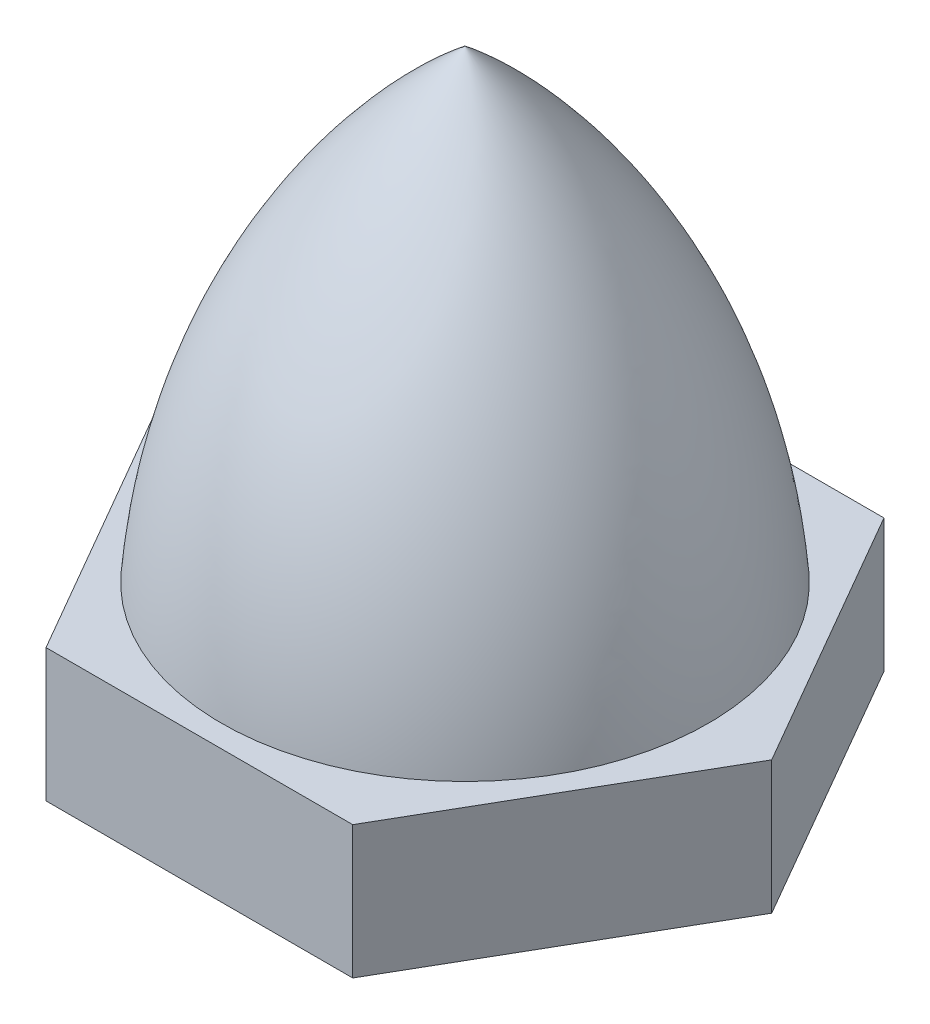
ISO-10303-21;
HEADER;
FILE_DESCRIPTION(('STEP AP214'),'2;1');
FILE_NAME('part.step','',(''),(''),'','','');
FILE_SCHEMA(('AUTOMOTIVE_DESIGN { 1 0 10303 214 1 1 1 1 }'));
ENDSEC;
DATA;
#1=APPLICATION_CONTEXT('core data for automotive mechanical design processes');
#2=APPLICATION_PROTOCOL_DEFINITION('international standard','automotive_design',2000,#1);
#3=PRODUCT_CONTEXT('',#1,'mechanical');
#4=PRODUCT('Part','Part','',(#3));
#5=PRODUCT_RELATED_PRODUCT_CATEGORY('part','',(#4));
#6=PRODUCT_DEFINITION_FORMATION('','',#4);
#7=PRODUCT_DEFINITION_CONTEXT('part definition',#1,'design');
#8=PRODUCT_DEFINITION('design','',#6,#7);
#9=PRODUCT_DEFINITION_SHAPE('','',#8);
#10=(LENGTH_UNIT() NAMED_UNIT(*) SI_UNIT(.MILLI.,.METRE.));
#11=(NAMED_UNIT(*) PLANE_ANGLE_UNIT() SI_UNIT($,.RADIAN.));
#12=(NAMED_UNIT(*) SI_UNIT($,.STERADIAN.) SOLID_ANGLE_UNIT());
#13=UNCERTAINTY_MEASURE_WITH_UNIT(LENGTH_MEASURE(1.E-05),#10,'distance_accuracy_value','');
#14=(GEOMETRIC_REPRESENTATION_CONTEXT(3) GLOBAL_UNCERTAINTY_ASSIGNED_CONTEXT((#13)) GLOBAL_UNIT_ASSIGNED_CONTEXT((#10,
#11,#12)) REPRESENTATION_CONTEXT('',''));
#15=CARTESIAN_POINT('',(0.,0.,0.));
#16=DIRECTION('',(0.,0.,1.));
#17=DIRECTION('',(1.,0.,0.));
#18=AXIS2_PLACEMENT_3D('',#15,#16,#17);
#19=CARTESIAN_POINT('',(0.,14.8986142757316,0.));
#20=DIRECTION('',(0.,-1.,0.));
#21=DIRECTION('',(0.,0.,-1.));
#22=AXIS2_PLACEMENT_3D('',#19,#20,#21);
#23=PLANE('',#22);
#24=DIRECTION('',(-0.5,0.,0.866025403784439));
#25=VECTOR('',#24,1.);
#26=CARTESIAN_POINT('',(18.0071692327859,14.8986142757316,0.));
#27=LINE('',#26,#25);
#28=CARTESIAN_POINT('',(18.0071692327859,14.8986142757316,0.));
#29=VERTEX_POINT('',#28);
#30=CARTESIAN_POINT('',(14.5430676176482,14.8986142757316,6.));
#31=VERTEX_POINT('',#30);
#32=EDGE_CURVE('E122',#29,#31,#27,.T.);
#33=ORIENTED_EDGE('',*,*,#32,.F.);
#34=DIRECTION('',(0.5,0.,0.866025403784439));
#35=VECTOR('',#34,1.);
#36=CARTESIAN_POINT('',(14.5430676176482,14.8986142757316,-6.));
#37=LINE('',#36,#35);
#38=CARTESIAN_POINT('',(14.5430676176482,14.8986142757316,-6.));
#39=VERTEX_POINT('',#38);
#40=EDGE_CURVE('E78',#39,#29,#37,.T.);
#41=ORIENTED_EDGE('',*,*,#40,.F.);
#42=DIRECTION('',(1.,0.,0.));
#43=VECTOR('',#42,1.);
#44=CARTESIAN_POINT('',(7.61486438737266,14.8986142757316,-6.));
#45=LINE('',#44,#43);
#46=CARTESIAN_POINT('',(7.61486438737266,14.8986142757316,-6.));
#47=VERTEX_POINT('',#46);
#48=EDGE_CURVE('E131',#47,#39,#45,.T.);
#49=ORIENTED_EDGE('',*,*,#48,.F.);
#50=DIRECTION('',(0.5,0.,-0.866025403784439));
#51=VECTOR('',#50,1.);
#52=CARTESIAN_POINT('',(4.15076277223491,14.8986142757316,0.));
#53=LINE('',#52,#51);
#54=CARTESIAN_POINT('',(4.15076277223491,14.8986142757316,0.));
#55=VERTEX_POINT('',#54);
#56=EDGE_CURVE('E110',#55,#47,#53,.T.);
#57=ORIENTED_EDGE('',*,*,#56,.F.);
#58=DIRECTION('',(-0.5,0.,-0.866025403784439));
#59=VECTOR('',#58,1.);
#60=CARTESIAN_POINT('',(7.61486438737266,14.8986142757316,6.));
#61=LINE('',#60,#59);
#62=CARTESIAN_POINT('',(7.61486438737266,14.8986142757316,6.));
#63=VERTEX_POINT('',#62);
#64=EDGE_CURVE('E128',#63,#55,#61,.T.);
#65=ORIENTED_EDGE('',*,*,#64,.F.);
#66=DIRECTION('',(-1.,0.,0.));
#67=VECTOR('',#66,1.);
#68=CARTESIAN_POINT('',(14.5430676176482,14.8986142757316,6.));
#69=LINE('',#68,#67);
#70=EDGE_CURVE('E125',#31,#63,#69,.T.);
#71=ORIENTED_EDGE('',*,*,#70,.F.);
#72=EDGE_LOOP('',(#33,#41,#49,#57,#65,#71));
#73=FACE_BOUND('',#72,.T.);
#74=CARTESIAN_POINT('',(11.0789660025104,14.8986142757316,0.));
#75=DIRECTION('',(0.,-1.,0.));
#76=DIRECTION('',(0.,0.,-1.));
#77=AXIS2_PLACEMENT_3D('',#74,#75,#76);
#78=CIRCLE('',#77,5.5);
#79=CARTESIAN_POINT('',(11.0789660025104,14.8986142757316,-5.5));
#80=VERTEX_POINT('',#79);
#81=EDGE_CURVE('E11',#80,#80,#78,.T.);
#82=ORIENTED_EDGE('',*,*,#81,.T.);
#83=EDGE_LOOP('',(#82));
#84=FACE_BOUND('',#83,.T.);
#85=ADVANCED_FACE('F33',(#73,#84),#23,.F.);
#86=CARTESIAN_POINT('',(18.0071692327859,11.8986142757316,0.));
#87=DIRECTION('',(-0.866025403784439,0.,-0.5));
#88=DIRECTION('',(-0.5,0.,0.866025403784439));
#89=AXIS2_PLACEMENT_3D('',#86,#87,#88);
#90=PLANE('',#89);
#91=ORIENTED_EDGE('',*,*,#32,.T.);
#92=DIRECTION('',(0.,1.,0.));
#93=VECTOR('',#92,1.);
#94=CARTESIAN_POINT('',(14.5430676176482,11.8986142757316,6.));
#95=LINE('',#94,#93);
#96=CARTESIAN_POINT('',(14.5430676176482,11.8986142757316,6.));
#97=VERTEX_POINT('',#96);
#98=EDGE_CURVE('E41',#97,#31,#95,.T.);
#99=ORIENTED_EDGE('',*,*,#98,.F.);
#100=DIRECTION('',(-0.5,0.,0.866025403784439));
#101=VECTOR('',#100,1.);
#102=CARTESIAN_POINT('',(18.0071692327859,11.8986142757316,0.));
#103=LINE('',#102,#101);
#104=CARTESIAN_POINT('',(18.0071692327859,11.8986142757316,0.));
#105=VERTEX_POINT('',#104);
#106=EDGE_CURVE('E134',#105,#97,#103,.T.);
#107=ORIENTED_EDGE('',*,*,#106,.F.);
#108=DIRECTION('',(0.,1.,0.));
#109=VECTOR('',#108,1.);
#110=CARTESIAN_POINT('',(18.0071692327859,11.8986142757316,0.));
#111=LINE('',#110,#109);
#112=EDGE_CURVE('E118',#105,#29,#111,.T.);
#113=ORIENTED_EDGE('',*,*,#112,.T.);
#114=EDGE_LOOP('',(#91,#99,#107,#113));
#115=FACE_BOUND('',#114,.T.);
#116=ADVANCED_FACE('F145',(#115),#90,.F.);
#117=CARTESIAN_POINT('',(14.5430676176482,11.8986142757316,6.));
#118=DIRECTION('',(0.,0.,-1.));
#119=DIRECTION('',(-1.,0.,0.));
#120=AXIS2_PLACEMENT_3D('',#117,#118,#119);
#121=PLANE('',#120);
#122=ORIENTED_EDGE('',*,*,#70,.T.);
#123=DIRECTION('',(0.,1.,0.));
#124=VECTOR('',#123,1.);
#125=CARTESIAN_POINT('',(7.61486438737267,11.8986142757316,6.));
#126=LINE('',#125,#124);
#127=CARTESIAN_POINT('',(7.61486438737267,11.8986142757316,6.));
#128=VERTEX_POINT('',#127);
#129=EDGE_CURVE('E138',#128,#63,#126,.T.);
#130=ORIENTED_EDGE('',*,*,#129,.F.);
#131=DIRECTION('',(-1.,0.,0.));
#132=VECTOR('',#131,1.);
#133=CARTESIAN_POINT('',(14.5430676176482,11.8986142757316,6.));
#134=LINE('',#133,#132);
#135=EDGE_CURVE('E87',#97,#128,#134,.T.);
#136=ORIENTED_EDGE('',*,*,#135,.F.);
#137=ORIENTED_EDGE('',*,*,#98,.T.);
#138=EDGE_LOOP('',(#122,#130,#136,#137));
#139=FACE_BOUND('',#138,.T.);
#140=ADVANCED_FACE('F141',(#139),#121,.F.);
#141=CARTESIAN_POINT('',(7.61486438737267,11.8986142757316,6.));
#142=DIRECTION('',(0.866025403784439,0.,-0.5));
#143=DIRECTION('',(-0.5,0.,-0.866025403784439));
#144=AXIS2_PLACEMENT_3D('',#141,#142,#143);
#145=PLANE('',#144);
#146=ORIENTED_EDGE('',*,*,#64,.T.);
#147=DIRECTION('',(0.,1.,0.));
#148=VECTOR('',#147,1.);
#149=CARTESIAN_POINT('',(4.15076277223491,11.8986142757316,0.));
#150=LINE('',#149,#148);
#151=CARTESIAN_POINT('',(4.15076277223491,11.8986142757316,0.));
#152=VERTEX_POINT('',#151);
#153=EDGE_CURVE('E113',#152,#55,#150,.T.);
#154=ORIENTED_EDGE('',*,*,#153,.F.);
#155=DIRECTION('',(-0.5,0.,-0.866025403784439));
#156=VECTOR('',#155,1.);
#157=CARTESIAN_POINT('',(7.61486438737267,11.8986142757316,6.));
#158=LINE('',#157,#156);
#159=EDGE_CURVE('E101',#128,#152,#158,.T.);
#160=ORIENTED_EDGE('',*,*,#159,.F.);
#161=ORIENTED_EDGE('',*,*,#129,.T.);
#162=EDGE_LOOP('',(#146,#154,#160,#161));
#163=FACE_BOUND('',#162,.T.);
#164=ADVANCED_FACE('F150',(#163),#145,.F.);
#165=CARTESIAN_POINT('',(4.15076277223491,11.8986142757316,0.));
#166=DIRECTION('',(0.866025403784439,0.,0.5));
#167=DIRECTION('',(0.5,0.,-0.866025403784439));
#168=AXIS2_PLACEMENT_3D('',#165,#166,#167);
#169=PLANE('',#168);
#170=ORIENTED_EDGE('',*,*,#56,.T.);
#171=DIRECTION('',(0.,1.,0.));
#172=VECTOR('',#171,1.);
#173=CARTESIAN_POINT('',(7.61486438737266,11.8986142757316,-6.));
#174=LINE('',#173,#172);
#175=CARTESIAN_POINT('',(7.61486438737266,11.8986142757316,-6.));
#176=VERTEX_POINT('',#175);
#177=EDGE_CURVE('E107',#176,#47,#174,.T.);
#178=ORIENTED_EDGE('',*,*,#177,.F.);
#179=DIRECTION('',(0.5,0.,-0.866025403784439));
#180=VECTOR('',#179,1.);
#181=CARTESIAN_POINT('',(4.15076277223491,11.8986142757316,0.));
#182=LINE('',#181,#180);
#183=EDGE_CURVE('E94',#152,#176,#182,.T.);
#184=ORIENTED_EDGE('',*,*,#183,.F.);
#185=ORIENTED_EDGE('',*,*,#153,.T.);
#186=EDGE_LOOP('',(#170,#178,#184,#185));
#187=FACE_BOUND('',#186,.T.);
#188=ADVANCED_FACE('F108',(#187),#169,.F.);
#189=CARTESIAN_POINT('',(7.61486438737266,11.8986142757316,-6.));
#190=DIRECTION('',(0.,0.,1.));
#191=DIRECTION('',(1.,0.,0.));
#192=AXIS2_PLACEMENT_3D('',#189,#190,#191);
#193=PLANE('',#192);
#194=ORIENTED_EDGE('',*,*,#48,.T.);
#195=DIRECTION('',(0.,1.,0.));
#196=VECTOR('',#195,1.);
#197=CARTESIAN_POINT('',(14.5430676176482,11.8986142757316,-6.));
#198=LINE('',#197,#196);
#199=CARTESIAN_POINT('',(14.5430676176482,11.8986142757316,-6.));
#200=VERTEX_POINT('',#199);
#201=EDGE_CURVE('E114',#200,#39,#198,.T.);
#202=ORIENTED_EDGE('',*,*,#201,.F.);
#203=DIRECTION('',(1.,0.,0.));
#204=VECTOR('',#203,1.);
#205=CARTESIAN_POINT('',(7.61486438737266,11.8986142757316,-6.));
#206=LINE('',#205,#204);
#207=EDGE_CURVE('E98',#176,#200,#206,.T.);
#208=ORIENTED_EDGE('',*,*,#207,.F.);
#209=ORIENTED_EDGE('',*,*,#177,.T.);
#210=EDGE_LOOP('',(#194,#202,#208,#209));
#211=FACE_BOUND('',#210,.T.);
#212=ADVANCED_FACE('F116',(#211),#193,.F.);
#213=CARTESIAN_POINT('',(14.5430676176482,11.8986142757316,-6.));
#214=DIRECTION('',(-0.866025403784439,0.,0.5));
#215=DIRECTION('',(0.5,0.,0.866025403784439));
#216=AXIS2_PLACEMENT_3D('',#213,#214,#215);
#217=PLANE('',#216);
#218=ORIENTED_EDGE('',*,*,#40,.T.);
#219=ORIENTED_EDGE('',*,*,#112,.F.);
#220=DIRECTION('',(0.5,0.,0.866025403784439));
#221=VECTOR('',#220,1.);
#222=CARTESIAN_POINT('',(14.5430676176482,11.8986142757316,-6.));
#223=LINE('',#222,#221);
#224=EDGE_CURVE('E52',#200,#105,#223,.T.);
#225=ORIENTED_EDGE('',*,*,#224,.F.);
#226=ORIENTED_EDGE('',*,*,#201,.T.);
#227=EDGE_LOOP('',(#218,#219,#225,#226));
#228=FACE_BOUND('',#227,.T.);
#229=ADVANCED_FACE('F169',(#228),#217,.F.);
#230=CARTESIAN_POINT('',(0.,11.8986142757316,0.));
#231=DIRECTION('',(0.,-1.,0.));
#232=DIRECTION('',(0.,0.,-1.));
#233=AXIS2_PLACEMENT_3D('',#230,#231,#232);
#234=PLANE('',#233);
#235=CARTESIAN_POINT('',(11.0789660025104,11.8986142757316,0.));
#236=DIRECTION('',(0.,-1.,0.));
#237=DIRECTION('',(0.,0.,-1.));
#238=AXIS2_PLACEMENT_3D('',#235,#236,#237);
#239=CIRCLE('',#238,2.5);
#240=CARTESIAN_POINT('',(11.0789660025104,11.8986142757316,-2.5));
#241=VERTEX_POINT('',#240);
#242=EDGE_CURVE('E154',#241,#241,#239,.T.);
#243=ORIENTED_EDGE('',*,*,#242,.F.);
#244=EDGE_LOOP('',(#243));
#245=FACE_BOUND('',#244,.T.);
#246=ORIENTED_EDGE('',*,*,#106,.T.);
#247=ORIENTED_EDGE('',*,*,#135,.T.);
#248=ORIENTED_EDGE('',*,*,#159,.T.);
#249=ORIENTED_EDGE('',*,*,#183,.T.);
#250=ORIENTED_EDGE('',*,*,#207,.T.);
#251=ORIENTED_EDGE('',*,*,#224,.T.);
#252=EDGE_LOOP('',(#246,#247,#248,#249,#250,#251));
#253=FACE_BOUND('',#252,.T.);
#254=ADVANCED_FACE('F96',(#245,#253),#234,.T.);
#255=CARTESIAN_POINT('',(20.5352938492373,13.7548234988747,0.));
#256=DIRECTION('',(0.,0.,-1.));
#257=DIRECTION('',(-1.,0.,0.));
#258=AXIS2_PLACEMENT_3D('',#255,#256,#257);
#259=CIRCLE('',#258,15.);
#260=TRIMMED_CURVE('',#259,(PARAMETER_VALUE(-0.888699782621585)),
(PARAMETER_VALUE(0.888699782621585)),.T.,.PARAMETER.);
#261=CARTESIAN_POINT('',(11.0789660025104,13.7548234988747,0.));
#262=DIRECTION('',(0.,1.,0.));
#263=AXIS1_PLACEMENT('',#261,#262);
#264=SURFACE_OF_REVOLUTION('',#260,#263);
#265=CARTESIAN_POINT('',(11.0789660025104,25.3986142757316,0.));
#266=VERTEX_POINT('',#265);
#267=VERTEX_LOOP('',#266);
#268=FACE_BOUND('',#267,.T.);
#269=ORIENTED_EDGE('',*,*,#81,.F.);
#270=EDGE_LOOP('',(#269));
#271=FACE_BOUND('',#270,.T.);
#272=ADVANCED_FACE('F35',(#268,#271),#264,.T.);
#273=CARTESIAN_POINT('',(11.0789660025104,22.3986142757316,0.));
#274=DIRECTION('',(0.,-1.,0.));
#275=DIRECTION('',(0.,0.,-1.));
#276=AXIS2_PLACEMENT_3D('',#273,#274,#275);
#277=CYLINDRICAL_SURFACE('',#276,2.5);
#278=CARTESIAN_POINT('',(11.0789660025104,22.3986142757316,0.));
#279=DIRECTION('',(0.,-1.,0.));
#280=DIRECTION('',(0.,0.,-1.));
#281=AXIS2_PLACEMENT_3D('',#278,#279,#280);
#282=CIRCLE('',#281,2.5);
#283=CARTESIAN_POINT('',(11.0789660025104,22.3986142757316,-2.5));
#284=VERTEX_POINT('',#283);
#285=EDGE_CURVE('E126',#284,#284,#282,.T.);
#286=ORIENTED_EDGE('',*,*,#285,.F.);
#287=EDGE_LOOP('',(#286));
#288=FACE_BOUND('',#287,.T.);
#289=ORIENTED_EDGE('',*,*,#242,.T.);
#290=EDGE_LOOP('',(#289));
#291=FACE_BOUND('',#290,.T.);
#292=ADVANCED_FACE('F162',(#288,#291),#277,.F.);
#293=CARTESIAN_POINT('',(11.0789660025104,22.3986142757316,0.));
#294=DIRECTION('',(0.,-1.,0.));
#295=DIRECTION('',(0.,0.,-1.));
#296=AXIS2_PLACEMENT_3D('',#293,#294,#295);
#297=PLANE('',#296);
#298=ORIENTED_EDGE('',*,*,#285,.T.);
#299=EDGE_LOOP('',(#298));
#300=FACE_BOUND('',#299,.T.);
#301=ADVANCED_FACE('F160',(#300),#297,.T.);
#302=CLOSED_SHELL('',(#85,#116,#140,#164,#188,#212,#229,#254,#272,#292,#301));
#303=MANIFOLD_SOLID_BREP('B2',#302);
#304=ADVANCED_BREP_SHAPE_REPRESENTATION('',(#18,#303),#14);
#305=SHAPE_DEFINITION_REPRESENTATION(#9,#304);
ENDSEC;
END-ISO-10303-21;
